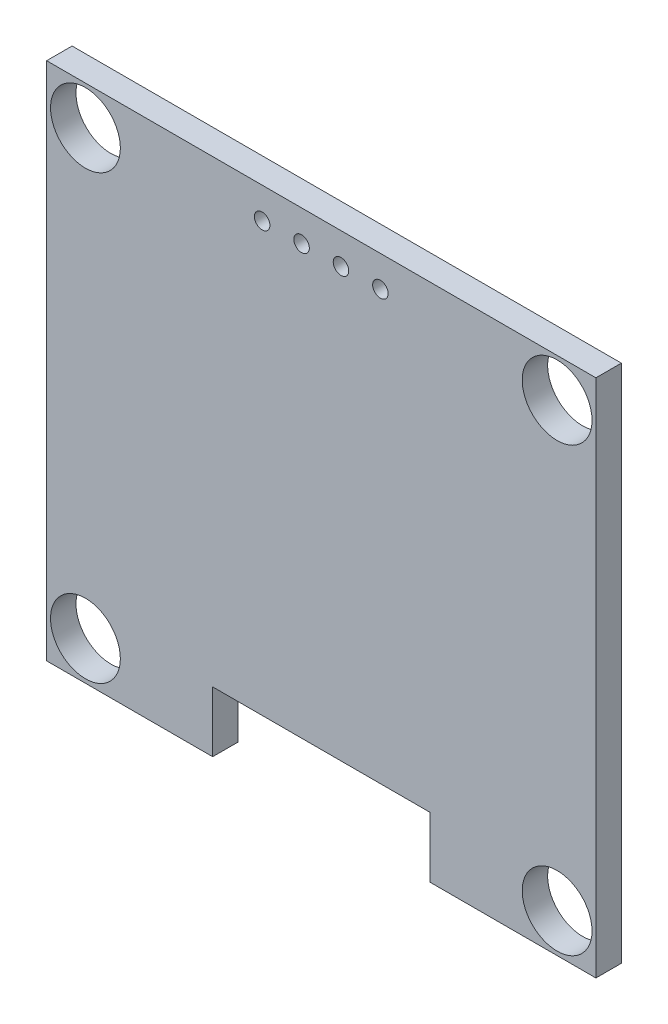
ISO-10303-21;
HEADER;
FILE_DESCRIPTION(('STEP AP214'),'2;1');
FILE_NAME('part.step','',(''),(''),'','','');
FILE_SCHEMA(('AUTOMOTIVE_DESIGN { 1 0 10303 214 1 1 1 1 }'));
ENDSEC;
DATA;
#1=APPLICATION_CONTEXT('core data for automotive mechanical design processes');
#2=APPLICATION_PROTOCOL_DEFINITION('international standard','automotive_design',2000,#1);
#3=PRODUCT_CONTEXT('',#1,'mechanical');
#4=PRODUCT('Part','Part','',(#3));
#5=PRODUCT_RELATED_PRODUCT_CATEGORY('part','',(#4));
#6=PRODUCT_DEFINITION_FORMATION('','',#4);
#7=PRODUCT_DEFINITION_CONTEXT('part definition',#1,'design');
#8=PRODUCT_DEFINITION('design','',#6,#7);
#9=PRODUCT_DEFINITION_SHAPE('','',#8);
#10=(LENGTH_UNIT() NAMED_UNIT(*) SI_UNIT(.MILLI.,.METRE.));
#11=(NAMED_UNIT(*) PLANE_ANGLE_UNIT() SI_UNIT($,.RADIAN.));
#12=(NAMED_UNIT(*) SI_UNIT($,.STERADIAN.) SOLID_ANGLE_UNIT());
#13=UNCERTAINTY_MEASURE_WITH_UNIT(LENGTH_MEASURE(1.E-05),#10,'distance_accuracy_value','');
#14=(GEOMETRIC_REPRESENTATION_CONTEXT(3) GLOBAL_UNCERTAINTY_ASSIGNED_CONTEXT((#13)) GLOBAL_UNIT_ASSIGNED_CONTEXT((#10,
#11,#12)) REPRESENTATION_CONTEXT('',''));
#15=CARTESIAN_POINT('',(0.,0.,0.));
#16=DIRECTION('',(0.,0.,1.));
#17=DIRECTION('',(1.,0.,0.));
#18=AXIS2_PLACEMENT_3D('',#15,#16,#17);
#19=CARTESIAN_POINT('',(-5.35,-33.5,1.64));
#20=DIRECTION('',(0.,-1.,0.));
#21=DIRECTION('',(0.,0.,-1.));
#22=AXIS2_PLACEMENT_3D('',#19,#20,#21);
#23=PLANE('',#22);
#24=DIRECTION('',(-1.,0.,0.));
#25=VECTOR('',#24,1.);
#26=CARTESIAN_POINT('',(-5.35,-33.5,0.));
#27=LINE('',#26,#25);
#28=CARTESIAN_POINT('',(0.,-33.5,0.));
#29=VERTEX_POINT('',#28);
#30=CARTESIAN_POINT('',(-10.7,-33.5,0.));
#31=VERTEX_POINT('',#30);
#32=EDGE_CURVE('E178',#29,#31,#27,.T.);
#33=ORIENTED_EDGE('',*,*,#32,.F.);
#34=DIRECTION('',(0.,0.,-1.));
#35=VECTOR('',#34,1.);
#36=CARTESIAN_POINT('',(0.,-33.5,1.64));
#37=LINE('',#36,#35);
#38=CARTESIAN_POINT('',(0.,-33.5,1.64));
#39=VERTEX_POINT('',#38);
#40=EDGE_CURVE('E11',#39,#29,#37,.T.);
#41=ORIENTED_EDGE('',*,*,#40,.F.);
#42=DIRECTION('',(-1.,0.,0.));
#43=VECTOR('',#42,1.);
#44=CARTESIAN_POINT('',(-5.35,-33.5,1.64));
#45=LINE('',#44,#43);
#46=CARTESIAN_POINT('',(-10.7,-33.5,1.64));
#47=VERTEX_POINT('',#46);
#48=EDGE_CURVE('E138',#39,#47,#45,.T.);
#49=ORIENTED_EDGE('',*,*,#48,.T.);
#50=DIRECTION('',(0.,0.,-1.));
#51=VECTOR('',#50,1.);
#52=CARTESIAN_POINT('',(-10.7,-33.5,1.64));
#53=LINE('',#52,#51);
#54=EDGE_CURVE('E170',#47,#31,#53,.T.);
#55=ORIENTED_EDGE('',*,*,#54,.T.);
#56=EDGE_LOOP('',(#33,#41,#49,#55));
#57=FACE_BOUND('',#56,.T.);
#58=ADVANCED_FACE('F16',(#57),#23,.T.);
#59=CARTESIAN_POINT('',(0.,-16.75,1.64));
#60=DIRECTION('',(1.,0.,0.));
#61=DIRECTION('',(0.,1.,0.));
#62=AXIS2_PLACEMENT_3D('',#59,#60,#61);
#63=PLANE('',#62);
#64=DIRECTION('',(0.,-1.,0.));
#65=VECTOR('',#64,1.);
#66=CARTESIAN_POINT('',(0.,-16.75,0.));
#67=LINE('',#66,#65);
#68=CARTESIAN_POINT('',(0.,0.,0.));
#69=VERTEX_POINT('',#68);
#70=EDGE_CURVE('E234',#69,#29,#67,.T.);
#71=ORIENTED_EDGE('',*,*,#70,.F.);
#72=DIRECTION('',(0.,0.,-1.));
#73=VECTOR('',#72,1.);
#74=CARTESIAN_POINT('',(0.,0.,1.64));
#75=LINE('',#74,#73);
#76=CARTESIAN_POINT('',(0.,0.,1.64));
#77=VERTEX_POINT('',#76);
#78=EDGE_CURVE('E27',#77,#69,#75,.T.);
#79=ORIENTED_EDGE('',*,*,#78,.F.);
#80=DIRECTION('',(0.,-1.,0.));
#81=VECTOR('',#80,1.);
#82=CARTESIAN_POINT('',(0.,-16.75,1.64));
#83=LINE('',#82,#81);
#84=EDGE_CURVE('E135',#77,#39,#83,.T.);
#85=ORIENTED_EDGE('',*,*,#84,.T.);
#86=ORIENTED_EDGE('',*,*,#40,.T.);
#87=EDGE_LOOP('',(#71,#79,#85,#86));
#88=FACE_BOUND('',#87,.T.);
#89=ADVANCED_FACE('F343',(#88),#63,.T.);
#90=CARTESIAN_POINT('',(-17.7,0.,1.64));
#91=DIRECTION('',(0.,-1.,0.));
#92=DIRECTION('',(0.,0.,-1.));
#93=AXIS2_PLACEMENT_3D('',#90,#91,#92);
#94=PLANE('',#93);
#95=DIRECTION('',(-1.,0.,0.));
#96=VECTOR('',#95,1.);
#97=CARTESIAN_POINT('',(-17.7,0.,0.));
#98=LINE('',#97,#96);
#99=CARTESIAN_POINT('',(-35.4,0.,0.));
#100=VERTEX_POINT('',#99);
#101=EDGE_CURVE('E133',#69,#100,#98,.T.);
#102=ORIENTED_EDGE('',*,*,#101,.T.);
#103=DIRECTION('',(0.,0.,-1.));
#104=VECTOR('',#103,1.);
#105=CARTESIAN_POINT('',(-35.4,0.,1.64));
#106=LINE('',#105,#104);
#107=CARTESIAN_POINT('',(-35.4,0.,1.64));
#108=VERTEX_POINT('',#107);
#109=EDGE_CURVE('E182',#108,#100,#106,.T.);
#110=ORIENTED_EDGE('',*,*,#109,.F.);
#111=DIRECTION('',(-1.,0.,0.));
#112=VECTOR('',#111,1.);
#113=CARTESIAN_POINT('',(-17.7,0.,1.64));
#114=LINE('',#113,#112);
#115=EDGE_CURVE('E137',#77,#108,#114,.T.);
#116=ORIENTED_EDGE('',*,*,#115,.F.);
#117=ORIENTED_EDGE('',*,*,#78,.T.);
#118=EDGE_LOOP('',(#102,#110,#116,#117));
#119=FACE_BOUND('',#118,.T.);
#120=ADVANCED_FACE('F267',(#119),#94,.F.);
#121=CARTESIAN_POINT('',(-35.4,-16.75,1.64));
#122=DIRECTION('',(1.,0.,0.));
#123=DIRECTION('',(0.,1.,0.));
#124=AXIS2_PLACEMENT_3D('',#121,#122,#123);
#125=PLANE('',#124);
#126=DIRECTION('',(0.,-1.,0.));
#127=VECTOR('',#126,1.);
#128=CARTESIAN_POINT('',(-35.4,-16.75,0.));
#129=LINE('',#128,#127);
#130=CARTESIAN_POINT('',(-35.4,-33.5,0.));
#131=VERTEX_POINT('',#130);
#132=EDGE_CURVE('E220',#100,#131,#129,.T.);
#133=ORIENTED_EDGE('',*,*,#132,.T.);
#134=DIRECTION('',(0.,0.,-1.));
#135=VECTOR('',#134,1.);
#136=CARTESIAN_POINT('',(-35.4,-33.5,1.64));
#137=LINE('',#136,#135);
#138=CARTESIAN_POINT('',(-35.4,-33.5,1.64));
#139=VERTEX_POINT('',#138);
#140=EDGE_CURVE('E196',#139,#131,#137,.T.);
#141=ORIENTED_EDGE('',*,*,#140,.F.);
#142=DIRECTION('',(0.,-1.,0.));
#143=VECTOR('',#142,1.);
#144=CARTESIAN_POINT('',(-35.4,-16.75,1.64));
#145=LINE('',#144,#143);
#146=EDGE_CURVE('E141',#108,#139,#145,.T.);
#147=ORIENTED_EDGE('',*,*,#146,.F.);
#148=ORIENTED_EDGE('',*,*,#109,.T.);
#149=EDGE_LOOP('',(#133,#141,#147,#148));
#150=FACE_BOUND('',#149,.T.);
#151=ADVANCED_FACE('F359',(#150),#125,.F.);
#152=CARTESIAN_POINT('',(-30.05,-33.5,1.64));
#153=DIRECTION('',(0.,-1.,0.));
#154=DIRECTION('',(0.,0.,-1.));
#155=AXIS2_PLACEMENT_3D('',#152,#153,#154);
#156=PLANE('',#155);
#157=DIRECTION('',(-1.,0.,0.));
#158=VECTOR('',#157,1.);
#159=CARTESIAN_POINT('',(-30.05,-33.5,0.));
#160=LINE('',#159,#158);
#161=CARTESIAN_POINT('',(-24.7,-33.5,0.));
#162=VERTEX_POINT('',#161);
#163=EDGE_CURVE('E192',#162,#131,#160,.T.);
#164=ORIENTED_EDGE('',*,*,#163,.F.);
#165=DIRECTION('',(0.,0.,-1.));
#166=VECTOR('',#165,1.);
#167=CARTESIAN_POINT('',(-24.7,-33.5,1.64));
#168=LINE('',#167,#166);
#169=CARTESIAN_POINT('',(-24.7,-33.5,1.64));
#170=VERTEX_POINT('',#169);
#171=EDGE_CURVE('E232',#170,#162,#168,.T.);
#172=ORIENTED_EDGE('',*,*,#171,.F.);
#173=DIRECTION('',(-1.,0.,0.));
#174=VECTOR('',#173,1.);
#175=CARTESIAN_POINT('',(-30.05,-33.5,1.64));
#176=LINE('',#175,#174);
#177=EDGE_CURVE('E150',#170,#139,#176,.T.);
#178=ORIENTED_EDGE('',*,*,#177,.T.);
#179=ORIENTED_EDGE('',*,*,#140,.T.);
#180=EDGE_LOOP('',(#164,#172,#178,#179));
#181=FACE_BOUND('',#180,.T.);
#182=ADVANCED_FACE('F276',(#181),#156,.T.);
#183=CARTESIAN_POINT('',(-24.7,-31.55,1.64));
#184=DIRECTION('',(-1.,0.,0.));
#185=DIRECTION('',(0.,0.,1.));
#186=AXIS2_PLACEMENT_3D('',#183,#184,#185);
#187=PLANE('',#186);
#188=DIRECTION('',(0.,1.,0.));
#189=VECTOR('',#188,1.);
#190=CARTESIAN_POINT('',(-24.7,-31.55,0.));
#191=LINE('',#190,#189);
#192=CARTESIAN_POINT('',(-24.7,-29.6,0.));
#193=VERTEX_POINT('',#192);
#194=EDGE_CURVE('E188',#162,#193,#191,.T.);
#195=ORIENTED_EDGE('',*,*,#194,.T.);
#196=DIRECTION('',(0.,0.,-1.));
#197=VECTOR('',#196,1.);
#198=CARTESIAN_POINT('',(-24.7,-29.6,1.64));
#199=LINE('',#198,#197);
#200=CARTESIAN_POINT('',(-24.7,-29.6,1.64));
#201=VERTEX_POINT('',#200);
#202=EDGE_CURVE('E168',#201,#193,#199,.T.);
#203=ORIENTED_EDGE('',*,*,#202,.F.);
#204=DIRECTION('',(0.,1.,0.));
#205=VECTOR('',#204,1.);
#206=CARTESIAN_POINT('',(-24.7,-31.55,1.64));
#207=LINE('',#206,#205);
#208=EDGE_CURVE('E159',#170,#201,#207,.T.);
#209=ORIENTED_EDGE('',*,*,#208,.F.);
#210=ORIENTED_EDGE('',*,*,#171,.T.);
#211=EDGE_LOOP('',(#195,#203,#209,#210));
#212=FACE_BOUND('',#211,.T.);
#213=ADVANCED_FACE('F18',(#212),#187,.F.);
#214=CARTESIAN_POINT('',(-2.5,-31.,1.64));
#215=DIRECTION('',(0.,0.,1.));
#216=DIRECTION('',(-1.,0.,0.));
#217=AXIS2_PLACEMENT_3D('',#214,#215,#216);
#218=CYLINDRICAL_SURFACE('',#217,2.25);
#219=CARTESIAN_POINT('',(-2.5,-31.,1.64));
#220=DIRECTION('',(0.,0.,1.));
#221=DIRECTION('',(1.,0.,0.));
#222=AXIS2_PLACEMENT_3D('',#219,#220,#221);
#223=CIRCLE('',#222,2.25);
#224=CARTESIAN_POINT('',(-0.25,-31.,1.64));
#225=VERTEX_POINT('',#224);
#226=EDGE_CURVE('E203',#225,#225,#223,.T.);
#227=ORIENTED_EDGE('',*,*,#226,.T.);
#228=EDGE_LOOP('',(#227));
#229=FACE_BOUND('',#228,.T.);
#230=CARTESIAN_POINT('',(-2.5,-31.,0.));
#231=DIRECTION('',(0.,0.,1.));
#232=DIRECTION('',(1.,0.,0.));
#233=AXIS2_PLACEMENT_3D('',#230,#231,#232);
#234=CIRCLE('',#233,2.25);
#235=CARTESIAN_POINT('',(-0.25,-31.,0.));
#236=VERTEX_POINT('',#235);
#237=EDGE_CURVE('E177',#236,#236,#234,.T.);
#238=ORIENTED_EDGE('',*,*,#237,.F.);
#239=EDGE_LOOP('',(#238));
#240=FACE_BOUND('',#239,.T.);
#241=ADVANCED_FACE('F374',(#229,#240),#218,.F.);
#242=CARTESIAN_POINT('',(-32.9,-31.,1.64));
#243=DIRECTION('',(0.,0.,1.));
#244=DIRECTION('',(-1.,0.,0.));
#245=AXIS2_PLACEMENT_3D('',#242,#243,#244);
#246=CYLINDRICAL_SURFACE('',#245,2.25);
#247=CARTESIAN_POINT('',(-32.9,-31.,1.64));
#248=DIRECTION('',(0.,0.,1.));
#249=DIRECTION('',(1.,0.,0.));
#250=AXIS2_PLACEMENT_3D('',#247,#248,#249);
#251=CIRCLE('',#250,2.25);
#252=CARTESIAN_POINT('',(-30.65,-31.,1.64));
#253=VERTEX_POINT('',#252);
#254=EDGE_CURVE('E245',#253,#253,#251,.T.);
#255=ORIENTED_EDGE('',*,*,#254,.T.);
#256=EDGE_LOOP('',(#255));
#257=FACE_BOUND('',#256,.T.);
#258=CARTESIAN_POINT('',(-32.9,-31.,0.));
#259=DIRECTION('',(0.,0.,1.));
#260=DIRECTION('',(1.,0.,0.));
#261=AXIS2_PLACEMENT_3D('',#258,#259,#260);
#262=CIRCLE('',#261,2.25);
#263=CARTESIAN_POINT('',(-30.65,-31.,0.));
#264=VERTEX_POINT('',#263);
#265=EDGE_CURVE('E20',#264,#264,#262,.T.);
#266=ORIENTED_EDGE('',*,*,#265,.F.);
#267=EDGE_LOOP('',(#266));
#268=FACE_BOUND('',#267,.T.);
#269=ADVANCED_FACE('F366',(#257,#268),#246,.F.);
#270=CARTESIAN_POINT('',(-32.9,-2.5,1.64));
#271=DIRECTION('',(0.,0.,1.));
#272=DIRECTION('',(-1.,0.,0.));
#273=AXIS2_PLACEMENT_3D('',#270,#271,#272);
#274=CYLINDRICAL_SURFACE('',#273,2.25);
#275=CARTESIAN_POINT('',(-32.9,-2.5,1.64));
#276=DIRECTION('',(0.,0.,1.));
#277=DIRECTION('',(1.,0.,0.));
#278=AXIS2_PLACEMENT_3D('',#275,#276,#277);
#279=CIRCLE('',#278,2.25);
#280=CARTESIAN_POINT('',(-30.65,-2.5,1.64));
#281=VERTEX_POINT('',#280);
#282=EDGE_CURVE('E230',#281,#281,#279,.T.);
#283=ORIENTED_EDGE('',*,*,#282,.T.);
#284=EDGE_LOOP('',(#283));
#285=FACE_BOUND('',#284,.T.);
#286=CARTESIAN_POINT('',(-32.9,-2.5,0.));
#287=DIRECTION('',(0.,0.,1.));
#288=DIRECTION('',(1.,0.,0.));
#289=AXIS2_PLACEMENT_3D('',#286,#287,#288);
#290=CIRCLE('',#289,2.25);
#291=CARTESIAN_POINT('',(-30.65,-2.5,0.));
#292=VERTEX_POINT('',#291);
#293=EDGE_CURVE('E167',#292,#292,#290,.T.);
#294=ORIENTED_EDGE('',*,*,#293,.F.);
#295=EDGE_LOOP('',(#294));
#296=FACE_BOUND('',#295,.T.);
#297=ADVANCED_FACE('F363',(#285,#296),#274,.F.);
#298=CARTESIAN_POINT('',(-2.5,-2.5,1.64));
#299=DIRECTION('',(0.,0.,1.));
#300=DIRECTION('',(-1.,0.,0.));
#301=AXIS2_PLACEMENT_3D('',#298,#299,#300);
#302=CYLINDRICAL_SURFACE('',#301,2.25);
#303=CARTESIAN_POINT('',(-2.5,-2.5,1.64));
#304=DIRECTION('',(0.,0.,1.));
#305=DIRECTION('',(1.,0.,0.));
#306=AXIS2_PLACEMENT_3D('',#303,#304,#305);
#307=CIRCLE('',#306,2.25);
#308=CARTESIAN_POINT('',(-0.25,-2.5,1.64));
#309=VERTEX_POINT('',#308);
#310=EDGE_CURVE('E129',#309,#309,#307,.T.);
#311=ORIENTED_EDGE('',*,*,#310,.T.);
#312=EDGE_LOOP('',(#311));
#313=FACE_BOUND('',#312,.T.);
#314=CARTESIAN_POINT('',(-2.5,-2.5,0.));
#315=DIRECTION('',(0.,0.,1.));
#316=DIRECTION('',(1.,0.,0.));
#317=AXIS2_PLACEMENT_3D('',#314,#315,#316);
#318=CIRCLE('',#317,2.25);
#319=CARTESIAN_POINT('',(-0.25,-2.5,0.));
#320=VERTEX_POINT('',#319);
#321=EDGE_CURVE('E165',#320,#320,#318,.T.);
#322=ORIENTED_EDGE('',*,*,#321,.F.);
#323=EDGE_LOOP('',(#322));
#324=FACE_BOUND('',#323,.T.);
#325=ADVANCED_FACE('F365',(#313,#324),#302,.F.);
#326=CARTESIAN_POINT('',(-16.43,-2.,1.64));
#327=DIRECTION('',(0.,0.,1.));
#328=DIRECTION('',(-1.,0.,0.));
#329=AXIS2_PLACEMENT_3D('',#326,#327,#328);
#330=CYLINDRICAL_SURFACE('',#329,0.5);
#331=CARTESIAN_POINT('',(-16.43,-2.,1.64));
#332=DIRECTION('',(0.,0.,1.));
#333=DIRECTION('',(1.,0.,0.));
#334=AXIS2_PLACEMENT_3D('',#331,#332,#333);
#335=CIRCLE('',#334,0.5);
#336=CARTESIAN_POINT('',(-15.93,-2.,1.64));
#337=VERTEX_POINT('',#336);
#338=EDGE_CURVE('E120',#337,#337,#335,.T.);
#339=ORIENTED_EDGE('',*,*,#338,.T.);
#340=EDGE_LOOP('',(#339));
#341=FACE_BOUND('',#340,.T.);
#342=CARTESIAN_POINT('',(-16.43,-2.,0.));
#343=DIRECTION('',(0.,0.,1.));
#344=DIRECTION('',(1.,0.,0.));
#345=AXIS2_PLACEMENT_3D('',#342,#343,#344);
#346=CIRCLE('',#345,0.5);
#347=CARTESIAN_POINT('',(-15.93,-2.,0.));
#348=VERTEX_POINT('',#347);
#349=EDGE_CURVE('E163',#348,#348,#346,.T.);
#350=ORIENTED_EDGE('',*,*,#349,.F.);
#351=EDGE_LOOP('',(#350));
#352=FACE_BOUND('',#351,.T.);
#353=ADVANCED_FACE('F371',(#341,#352),#330,.F.);
#354=CARTESIAN_POINT('',(-18.97,-2.,1.64));
#355=DIRECTION('',(0.,0.,1.));
#356=DIRECTION('',(-1.,0.,0.));
#357=AXIS2_PLACEMENT_3D('',#354,#355,#356);
#358=CYLINDRICAL_SURFACE('',#357,0.5);
#359=CARTESIAN_POINT('',(-18.97,-2.,1.64));
#360=DIRECTION('',(0.,0.,1.));
#361=DIRECTION('',(1.,0.,0.));
#362=AXIS2_PLACEMENT_3D('',#359,#360,#361);
#363=CIRCLE('',#362,0.5);
#364=CARTESIAN_POINT('',(-18.47,-2.,1.64));
#365=VERTEX_POINT('',#364);
#366=EDGE_CURVE('E114',#365,#365,#363,.T.);
#367=ORIENTED_EDGE('',*,*,#366,.T.);
#368=EDGE_LOOP('',(#367));
#369=FACE_BOUND('',#368,.T.);
#370=CARTESIAN_POINT('',(-18.97,-2.,0.));
#371=DIRECTION('',(0.,0.,1.));
#372=DIRECTION('',(1.,0.,0.));
#373=AXIS2_PLACEMENT_3D('',#370,#371,#372);
#374=CIRCLE('',#373,0.5);
#375=CARTESIAN_POINT('',(-18.47,-2.,0.));
#376=VERTEX_POINT('',#375);
#377=EDGE_CURVE('E197',#376,#376,#374,.T.);
#378=ORIENTED_EDGE('',*,*,#377,.F.);
#379=EDGE_LOOP('',(#378));
#380=FACE_BOUND('',#379,.T.);
#381=ADVANCED_FACE('F115',(#369,#380),#358,.F.);
#382=CARTESIAN_POINT('',(-21.51,-2.,1.64));
#383=DIRECTION('',(0.,0.,1.));
#384=DIRECTION('',(-1.,0.,0.));
#385=AXIS2_PLACEMENT_3D('',#382,#383,#384);
#386=CYLINDRICAL_SURFACE('',#385,0.5);
#387=CARTESIAN_POINT('',(-21.51,-2.,1.64));
#388=DIRECTION('',(0.,0.,1.));
#389=DIRECTION('',(1.,0.,0.));
#390=AXIS2_PLACEMENT_3D('',#387,#388,#389);
#391=CIRCLE('',#390,0.5);
#392=CARTESIAN_POINT('',(-21.01,-2.,1.64));
#393=VERTEX_POINT('',#392);
#394=EDGE_CURVE('E119',#393,#393,#391,.T.);
#395=ORIENTED_EDGE('',*,*,#394,.T.);
#396=EDGE_LOOP('',(#395));
#397=FACE_BOUND('',#396,.T.);
#398=CARTESIAN_POINT('',(-21.51,-2.,0.));
#399=DIRECTION('',(0.,0.,1.));
#400=DIRECTION('',(1.,0.,0.));
#401=AXIS2_PLACEMENT_3D('',#398,#399,#400);
#402=CIRCLE('',#401,0.5);
#403=CARTESIAN_POINT('',(-21.01,-2.,0.));
#404=VERTEX_POINT('',#403);
#405=EDGE_CURVE('E39',#404,#404,#402,.T.);
#406=ORIENTED_EDGE('',*,*,#405,.F.);
#407=EDGE_LOOP('',(#406));
#408=FACE_BOUND('',#407,.T.);
#409=ADVANCED_FACE('F361',(#397,#408),#386,.F.);
#410=CARTESIAN_POINT('',(-10.7,-31.55,1.64));
#411=DIRECTION('',(1.,0.,0.));
#412=DIRECTION('',(0.,1.,0.));
#413=AXIS2_PLACEMENT_3D('',#410,#411,#412);
#414=PLANE('',#413);
#415=DIRECTION('',(0.,-1.,0.));
#416=VECTOR('',#415,1.);
#417=CARTESIAN_POINT('',(-10.7,-31.55,0.));
#418=LINE('',#417,#416);
#419=CARTESIAN_POINT('',(-10.7,-29.6,0.));
#420=VERTEX_POINT('',#419);
#421=EDGE_CURVE('E173',#420,#31,#418,.T.);
#422=ORIENTED_EDGE('',*,*,#421,.T.);
#423=ORIENTED_EDGE('',*,*,#54,.F.);
#424=DIRECTION('',(0.,-1.,0.));
#425=VECTOR('',#424,1.);
#426=CARTESIAN_POINT('',(-10.7,-31.55,1.64));
#427=LINE('',#426,#425);
#428=CARTESIAN_POINT('',(-10.7,-29.6,1.64));
#429=VERTEX_POINT('',#428);
#430=EDGE_CURVE('E183',#429,#47,#427,.T.);
#431=ORIENTED_EDGE('',*,*,#430,.F.);
#432=DIRECTION('',(0.,0.,-1.));
#433=VECTOR('',#432,1.);
#434=CARTESIAN_POINT('',(-10.7,-29.6,1.64));
#435=LINE('',#434,#433);
#436=EDGE_CURVE('E171',#429,#420,#435,.T.);
#437=ORIENTED_EDGE('',*,*,#436,.T.);
#438=EDGE_LOOP('',(#422,#423,#431,#437));
#439=FACE_BOUND('',#438,.T.);
#440=ADVANCED_FACE('F355',(#439),#414,.F.);
#441=CARTESIAN_POINT('',(-17.7,-29.6,1.64));
#442=DIRECTION('',(0.,1.,0.));
#443=DIRECTION('',(1.,0.,0.));
#444=AXIS2_PLACEMENT_3D('',#441,#442,#443);
#445=PLANE('',#444);
#446=DIRECTION('',(1.,0.,0.));
#447=VECTOR('',#446,1.);
#448=CARTESIAN_POINT('',(-17.7,-29.6,0.));
#449=LINE('',#448,#447);
#450=EDGE_CURVE('E193',#193,#420,#449,.T.);
#451=ORIENTED_EDGE('',*,*,#450,.T.);
#452=ORIENTED_EDGE('',*,*,#436,.F.);
#453=DIRECTION('',(1.,0.,0.));
#454=VECTOR('',#453,1.);
#455=CARTESIAN_POINT('',(-17.7,-29.6,1.64));
#456=LINE('',#455,#454);
#457=EDGE_CURVE('E187',#201,#429,#456,.T.);
#458=ORIENTED_EDGE('',*,*,#457,.F.);
#459=ORIENTED_EDGE('',*,*,#202,.T.);
#460=EDGE_LOOP('',(#451,#452,#458,#459));
#461=FACE_BOUND('',#460,.T.);
#462=ADVANCED_FACE('F338',(#461),#445,.F.);
#463=CARTESIAN_POINT('',(-17.7,-16.75,0.));
#464=DIRECTION('',(0.,0.,1.));
#465=DIRECTION('',(1.,0.,0.));
#466=AXIS2_PLACEMENT_3D('',#463,#464,#465);
#467=PLANE('',#466);
#468=CARTESIAN_POINT('',(-13.89,-2.,0.));
#469=DIRECTION('',(0.,0.,1.));
#470=DIRECTION('',(1.,0.,0.));
#471=AXIS2_PLACEMENT_3D('',#468,#469,#470);
#472=CIRCLE('',#471,0.5);
#473=CARTESIAN_POINT('',(-13.39,-2.,0.));
#474=VERTEX_POINT('',#473);
#475=EDGE_CURVE('E212',#474,#474,#472,.T.);
#476=ORIENTED_EDGE('',*,*,#475,.T.);
#477=EDGE_LOOP('',(#476));
#478=FACE_BOUND('',#477,.T.);
#479=ORIENTED_EDGE('',*,*,#405,.T.);
#480=EDGE_LOOP('',(#479));
#481=FACE_BOUND('',#480,.T.);
#482=ORIENTED_EDGE('',*,*,#377,.T.);
#483=EDGE_LOOP('',(#482));
#484=FACE_BOUND('',#483,.T.);
#485=ORIENTED_EDGE('',*,*,#349,.T.);
#486=EDGE_LOOP('',(#485));
#487=FACE_BOUND('',#486,.T.);
#488=ORIENTED_EDGE('',*,*,#321,.T.);
#489=EDGE_LOOP('',(#488));
#490=FACE_BOUND('',#489,.T.);
#491=ORIENTED_EDGE('',*,*,#293,.T.);
#492=EDGE_LOOP('',(#491));
#493=FACE_BOUND('',#492,.T.);
#494=ORIENTED_EDGE('',*,*,#265,.T.);
#495=EDGE_LOOP('',(#494));
#496=FACE_BOUND('',#495,.T.);
#497=ORIENTED_EDGE('',*,*,#237,.T.);
#498=EDGE_LOOP('',(#497));
#499=FACE_BOUND('',#498,.T.);
#500=ORIENTED_EDGE('',*,*,#450,.F.);
#501=ORIENTED_EDGE('',*,*,#194,.F.);
#502=ORIENTED_EDGE('',*,*,#163,.T.);
#503=ORIENTED_EDGE('',*,*,#132,.F.);
#504=ORIENTED_EDGE('',*,*,#101,.F.);
#505=ORIENTED_EDGE('',*,*,#70,.T.);
#506=ORIENTED_EDGE('',*,*,#32,.T.);
#507=ORIENTED_EDGE('',*,*,#421,.F.);
#508=EDGE_LOOP('',(#500,#501,#502,#503,#504,#505,#506,#507));
#509=FACE_BOUND('',#508,.T.);
#510=ADVANCED_FACE('F272',(#478,#481,#484,#487,#490,#493,#496,#499,#509),#467,.F.);
#511=CARTESIAN_POINT('',(-13.89,-2.,1.64));
#512=DIRECTION('',(0.,0.,1.));
#513=DIRECTION('',(-1.,0.,0.));
#514=AXIS2_PLACEMENT_3D('',#511,#512,#513);
#515=CYLINDRICAL_SURFACE('',#514,0.5);
#516=CARTESIAN_POINT('',(-13.89,-2.,1.64));
#517=DIRECTION('',(0.,0.,1.));
#518=DIRECTION('',(1.,0.,0.));
#519=AXIS2_PLACEMENT_3D('',#516,#517,#518);
#520=CIRCLE('',#519,0.5);
#521=CARTESIAN_POINT('',(-13.39,-2.,1.64));
#522=VERTEX_POINT('',#521);
#523=EDGE_CURVE('E126',#522,#522,#520,.T.);
#524=ORIENTED_EDGE('',*,*,#523,.T.);
#525=EDGE_LOOP('',(#524));
#526=FACE_BOUND('',#525,.T.);
#527=ORIENTED_EDGE('',*,*,#475,.F.);
#528=EDGE_LOOP('',(#527));
#529=FACE_BOUND('',#528,.T.);
#530=ADVANCED_FACE('F326',(#526,#529),#515,.F.);
#531=CARTESIAN_POINT('',(-17.7,-16.75,1.64));
#532=DIRECTION('',(0.,0.,1.));
#533=DIRECTION('',(1.,0.,0.));
#534=AXIS2_PLACEMENT_3D('',#531,#532,#533);
#535=PLANE('',#534);
#536=ORIENTED_EDGE('',*,*,#523,.F.);
#537=EDGE_LOOP('',(#536));
#538=FACE_BOUND('',#537,.T.);
#539=ORIENTED_EDGE('',*,*,#394,.F.);
#540=EDGE_LOOP('',(#539));
#541=FACE_BOUND('',#540,.T.);
#542=ORIENTED_EDGE('',*,*,#366,.F.);
#543=EDGE_LOOP('',(#542));
#544=FACE_BOUND('',#543,.T.);
#545=ORIENTED_EDGE('',*,*,#338,.F.);
#546=EDGE_LOOP('',(#545));
#547=FACE_BOUND('',#546,.T.);
#548=ORIENTED_EDGE('',*,*,#310,.F.);
#549=EDGE_LOOP('',(#548));
#550=FACE_BOUND('',#549,.T.);
#551=ORIENTED_EDGE('',*,*,#282,.F.);
#552=EDGE_LOOP('',(#551));
#553=FACE_BOUND('',#552,.T.);
#554=ORIENTED_EDGE('',*,*,#254,.F.);
#555=EDGE_LOOP('',(#554));
#556=FACE_BOUND('',#555,.T.);
#557=ORIENTED_EDGE('',*,*,#226,.F.);
#558=EDGE_LOOP('',(#557));
#559=FACE_BOUND('',#558,.T.);
#560=ORIENTED_EDGE('',*,*,#457,.T.);
#561=ORIENTED_EDGE('',*,*,#430,.T.);
#562=ORIENTED_EDGE('',*,*,#48,.F.);
#563=ORIENTED_EDGE('',*,*,#84,.F.);
#564=ORIENTED_EDGE('',*,*,#115,.T.);
#565=ORIENTED_EDGE('',*,*,#146,.T.);
#566=ORIENTED_EDGE('',*,*,#177,.F.);
#567=ORIENTED_EDGE('',*,*,#208,.T.);
#568=EDGE_LOOP('',(#560,#561,#562,#563,#564,#565,#566,#567));
#569=FACE_BOUND('',#568,.T.);
#570=ADVANCED_FACE('F328',(#538,#541,#544,#547,#550,#553,#556,#559,#569),#535,.T.);
#571=CLOSED_SHELL('',(#58,#89,#120,#151,#182,#213,#241,#269,#297,#325,#353,#381,#409,#440,#462,
#510,#530,#570));
#572=MANIFOLD_SOLID_BREP('B1',#571);
#573=ADVANCED_BREP_SHAPE_REPRESENTATION('',(#18,#572),#14);
#574=SHAPE_DEFINITION_REPRESENTATION(#9,#573);
ENDSEC;
END-ISO-10303-21;
